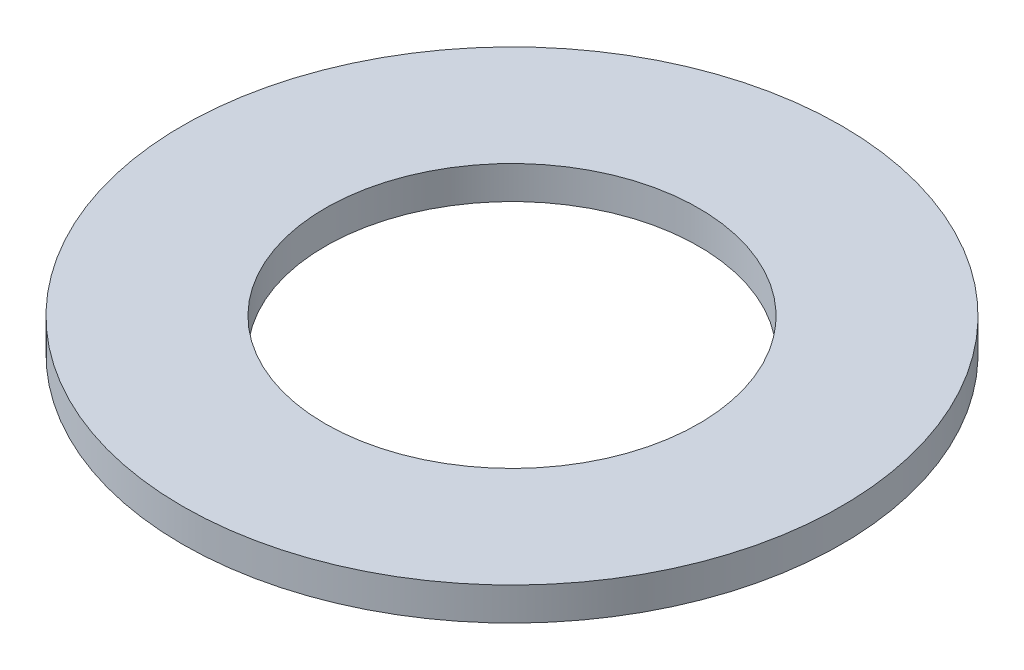
ISO-10303-21;
HEADER;
FILE_DESCRIPTION(('STEP AP214'),'2;1');
FILE_NAME('part.step','',(''),(''),'','','');
FILE_SCHEMA(('AUTOMOTIVE_DESIGN { 1 0 10303 214 1 1 1 1 }'));
ENDSEC;
DATA;
#1=APPLICATION_CONTEXT('core data for automotive mechanical design processes');
#2=APPLICATION_PROTOCOL_DEFINITION('international standard','automotive_design',2000,#1);
#3=PRODUCT_CONTEXT('',#1,'mechanical');
#4=PRODUCT('Part','Part','',(#3));
#5=PRODUCT_RELATED_PRODUCT_CATEGORY('part','',(#4));
#6=PRODUCT_DEFINITION_FORMATION('','',#4);
#7=PRODUCT_DEFINITION_CONTEXT('part definition',#1,'design');
#8=PRODUCT_DEFINITION('design','',#6,#7);
#9=PRODUCT_DEFINITION_SHAPE('','',#8);
#10=(LENGTH_UNIT() NAMED_UNIT(*) SI_UNIT(.MILLI.,.METRE.));
#11=(NAMED_UNIT(*) PLANE_ANGLE_UNIT() SI_UNIT($,.RADIAN.));
#12=(NAMED_UNIT(*) SI_UNIT($,.STERADIAN.) SOLID_ANGLE_UNIT());
#13=UNCERTAINTY_MEASURE_WITH_UNIT(LENGTH_MEASURE(1.E-05),#10,'distance_accuracy_value','');
#14=(GEOMETRIC_REPRESENTATION_CONTEXT(3) GLOBAL_UNCERTAINTY_ASSIGNED_CONTEXT((#13)) GLOBAL_UNIT_ASSIGNED_CONTEXT((#10,
#11,#12)) REPRESENTATION_CONTEXT('',''));
#15=CARTESIAN_POINT('',(0.,0.,0.));
#16=DIRECTION('',(0.,0.,1.));
#17=DIRECTION('',(1.,0.,0.));
#18=AXIS2_PLACEMENT_3D('',#15,#16,#17);
#19=CARTESIAN_POINT('',(0.,3.,0.));
#20=DIRECTION('',(0.,1.,0.));
#21=DIRECTION('',(0.,0.,1.));
#22=AXIS2_PLACEMENT_3D('',#19,#20,#21);
#23=PLANE('',#22);
#24=CARTESIAN_POINT('',(0.,3.,0.));
#25=DIRECTION('',(0.,1.,0.));
#26=DIRECTION('',(0.,0.,1.));
#27=AXIS2_PLACEMENT_3D('',#24,#25,#26);
#28=CIRCLE('',#27,30.);
#29=CARTESIAN_POINT('',(0.,3.,30.));
#30=VERTEX_POINT('',#29);
#31=EDGE_CURVE('E10',#30,#30,#28,.T.);
#32=ORIENTED_EDGE('',*,*,#31,.T.);
#33=EDGE_LOOP('',(#32));
#34=FACE_BOUND('',#33,.T.);
#35=CARTESIAN_POINT('',(0.,3.,0.));
#36=DIRECTION('',(0.,1.,0.));
#37=DIRECTION('',(0.,0.,1.));
#38=AXIS2_PLACEMENT_3D('',#35,#36,#37);
#39=CIRCLE('',#38,17.);
#40=CARTESIAN_POINT('',(0.,3.,17.));
#41=VERTEX_POINT('',#40);
#42=EDGE_CURVE('E40',#41,#41,#39,.T.);
#43=ORIENTED_EDGE('',*,*,#42,.F.);
#44=EDGE_LOOP('',(#43));
#45=FACE_BOUND('',#44,.T.);
#46=ADVANCED_FACE('F29',(#34,#45),#23,.T.);
#47=CARTESIAN_POINT('',(0.,0.,0.));
#48=DIRECTION('',(0.,1.,0.));
#49=DIRECTION('',(0.,0.,1.));
#50=AXIS2_PLACEMENT_3D('',#47,#48,#49);
#51=PLANE('',#50);
#52=CARTESIAN_POINT('',(0.,0.,0.));
#53=DIRECTION('',(0.,1.,0.));
#54=DIRECTION('',(0.,0.,1.));
#55=AXIS2_PLACEMENT_3D('',#52,#53,#54);
#56=CIRCLE('',#55,30.);
#57=CARTESIAN_POINT('',(0.,0.,30.));
#58=VERTEX_POINT('',#57);
#59=EDGE_CURVE('E33',#58,#58,#56,.T.);
#60=ORIENTED_EDGE('',*,*,#59,.F.);
#61=EDGE_LOOP('',(#60));
#62=FACE_BOUND('',#61,.T.);
#63=CARTESIAN_POINT('',(0.,0.,0.));
#64=DIRECTION('',(0.,1.,0.));
#65=DIRECTION('',(0.,0.,1.));
#66=AXIS2_PLACEMENT_3D('',#63,#64,#65);
#67=CIRCLE('',#66,17.);
#68=CARTESIAN_POINT('',(0.,0.,17.));
#69=VERTEX_POINT('',#68);
#70=EDGE_CURVE('E42',#69,#69,#67,.T.);
#71=ORIENTED_EDGE('',*,*,#70,.T.);
#72=EDGE_LOOP('',(#71));
#73=FACE_BOUND('',#72,.T.);
#74=ADVANCED_FACE('F52',(#62,#73),#51,.F.);
#75=CARTESIAN_POINT('',(0.,3.,0.));
#76=DIRECTION('',(0.,-1.,0.));
#77=DIRECTION('',(0.,0.,-1.));
#78=AXIS2_PLACEMENT_3D('',#75,#76,#77);
#79=CYLINDRICAL_SURFACE('',#78,30.);
#80=ORIENTED_EDGE('',*,*,#31,.F.);
#81=EDGE_LOOP('',(#80));
#82=FACE_BOUND('',#81,.T.);
#83=ORIENTED_EDGE('',*,*,#59,.T.);
#84=EDGE_LOOP('',(#83));
#85=FACE_BOUND('',#84,.T.);
#86=ADVANCED_FACE('F31',(#82,#85),#79,.T.);
#87=CARTESIAN_POINT('',(0.,3.,0.));
#88=DIRECTION('',(0.,-1.,0.));
#89=DIRECTION('',(0.,0.,-1.));
#90=AXIS2_PLACEMENT_3D('',#87,#88,#89);
#91=CYLINDRICAL_SURFACE('',#90,17.);
#92=ORIENTED_EDGE('',*,*,#42,.T.);
#93=EDGE_LOOP('',(#92));
#94=FACE_BOUND('',#93,.T.);
#95=ORIENTED_EDGE('',*,*,#70,.F.);
#96=EDGE_LOOP('',(#95));
#97=FACE_BOUND('',#96,.T.);
#98=ADVANCED_FACE('F48',(#94,#97),#91,.F.);
#99=CLOSED_SHELL('',(#46,#74,#86,#98));
#100=MANIFOLD_SOLID_BREP('B2',#99);
#101=ADVANCED_BREP_SHAPE_REPRESENTATION('',(#18,#100),#14);
#102=SHAPE_DEFINITION_REPRESENTATION(#9,#101);
ENDSEC;
END-ISO-10303-21;
